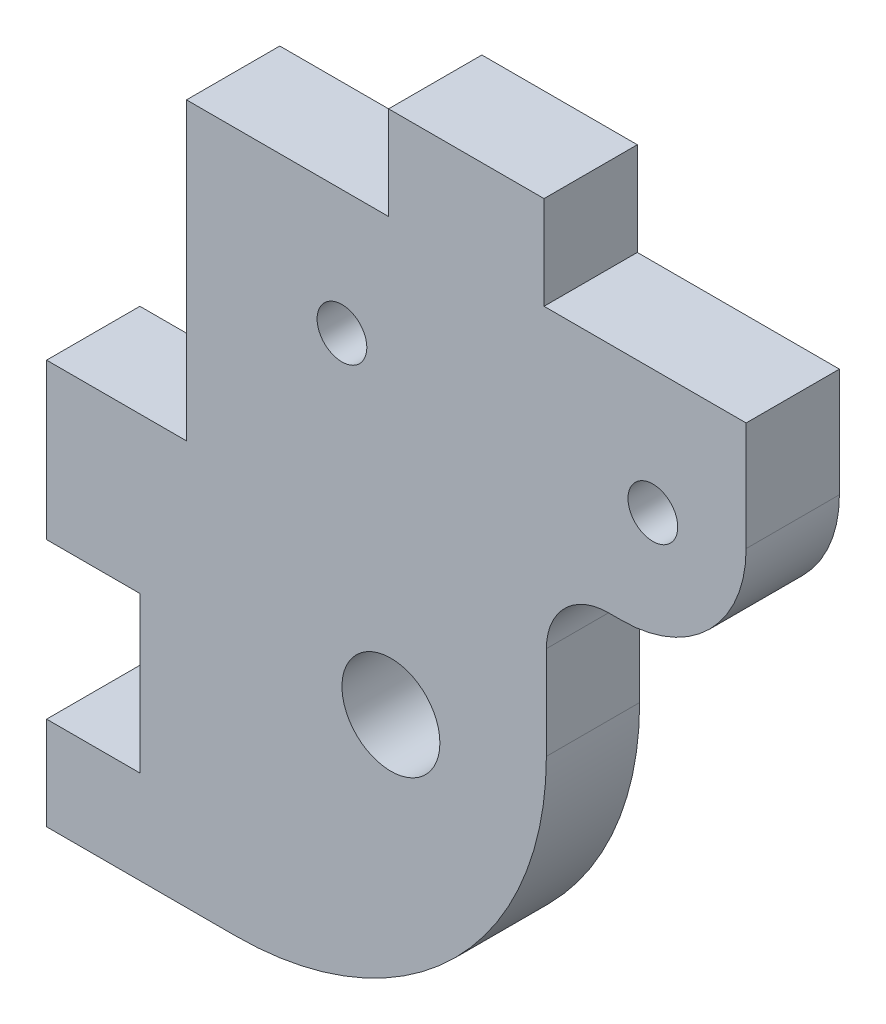
ISO-10303-21;
HEADER;
FILE_DESCRIPTION(('STEP AP214'),'2;1');
FILE_NAME('part.step','',(''),(''),'','','');
FILE_SCHEMA(('AUTOMOTIVE_DESIGN { 1 0 10303 214 1 1 1 1 }'));
ENDSEC;
DATA;
#1=APPLICATION_CONTEXT('core data for automotive mechanical design processes');
#2=APPLICATION_PROTOCOL_DEFINITION('international standard','automotive_design',2000,#1);
#3=PRODUCT_CONTEXT('',#1,'mechanical');
#4=PRODUCT('Part','Part','',(#3));
#5=PRODUCT_RELATED_PRODUCT_CATEGORY('part','',(#4));
#6=PRODUCT_DEFINITION_FORMATION('','',#4);
#7=PRODUCT_DEFINITION_CONTEXT('part definition',#1,'design');
#8=PRODUCT_DEFINITION('design','',#6,#7);
#9=PRODUCT_DEFINITION_SHAPE('','',#8);
#10=(LENGTH_UNIT() NAMED_UNIT(*) SI_UNIT(.MILLI.,.METRE.));
#11=(NAMED_UNIT(*) PLANE_ANGLE_UNIT() SI_UNIT($,.RADIAN.));
#12=(NAMED_UNIT(*) SI_UNIT($,.STERADIAN.) SOLID_ANGLE_UNIT());
#13=UNCERTAINTY_MEASURE_WITH_UNIT(LENGTH_MEASURE(1.E-05),#10,'distance_accuracy_value','');
#14=(GEOMETRIC_REPRESENTATION_CONTEXT(3) GLOBAL_UNCERTAINTY_ASSIGNED_CONTEXT((#13)) GLOBAL_UNIT_ASSIGNED_CONTEXT((#10,
#11,#12)) REPRESENTATION_CONTEXT('',''));
#15=CARTESIAN_POINT('',(0.,0.,0.));
#16=DIRECTION('',(0.,0.,1.));
#17=DIRECTION('',(1.,0.,0.));
#18=AXIS2_PLACEMENT_3D('',#15,#16,#17);
#19=CARTESIAN_POINT('',(9.,0.,6.));
#20=DIRECTION('',(-1.,0.,0.));
#21=DIRECTION('',(0.,0.,1.));
#22=AXIS2_PLACEMENT_3D('',#19,#20,#21);
#23=PLANE('',#22);
#24=DIRECTION('',(0.,1.,0.));
#25=VECTOR('',#24,1.);
#26=CARTESIAN_POINT('',(9.,0.,0.));
#27=LINE('',#26,#25);
#28=CARTESIAN_POINT('',(9.,-19.,0.));
#29=VERTEX_POINT('',#28);
#30=CARTESIAN_POINT('',(9.,0.,0.));
#31=VERTEX_POINT('',#30);
#32=EDGE_CURVE('E169',#29,#31,#27,.T.);
#33=ORIENTED_EDGE('',*,*,#32,.F.);
#34=DIRECTION('',(0.,0.,-1.));
#35=VECTOR('',#34,1.);
#36=CARTESIAN_POINT('',(9.,-19.,6.));
#37=LINE('',#36,#35);
#38=CARTESIAN_POINT('',(9.,-19.,6.));
#39=VERTEX_POINT('',#38);
#40=EDGE_CURVE('E164',#39,#29,#37,.T.);
#41=ORIENTED_EDGE('',*,*,#40,.F.);
#42=DIRECTION('',(0.,1.,0.));
#43=VECTOR('',#42,1.);
#44=CARTESIAN_POINT('',(9.,0.,6.));
#45=LINE('',#44,#43);
#46=CARTESIAN_POINT('',(9.,0.,6.));
#47=VERTEX_POINT('',#46);
#48=EDGE_CURVE('E166',#39,#47,#45,.T.);
#49=ORIENTED_EDGE('',*,*,#48,.T.);
#50=DIRECTION('',(0.,0.,-1.));
#51=VECTOR('',#50,1.);
#52=CARTESIAN_POINT('',(9.,0.,6.));
#53=LINE('',#52,#51);
#54=EDGE_CURVE('E269',#47,#31,#53,.T.);
#55=ORIENTED_EDGE('',*,*,#54,.T.);
#56=EDGE_LOOP('',(#33,#41,#49,#55));
#57=FACE_BOUND('',#56,.T.);
#58=ADVANCED_FACE('F35',(#57),#23,.T.);
#59=CARTESIAN_POINT('',(0.,-19.,6.));
#60=DIRECTION('',(0.,1.,0.));
#61=DIRECTION('',(0.,0.,1.));
#62=AXIS2_PLACEMENT_3D('',#59,#60,#61);
#63=PLANE('',#62);
#64=DIRECTION('',(1.,0.,0.));
#65=VECTOR('',#64,1.);
#66=CARTESIAN_POINT('',(0.,-19.,0.));
#67=LINE('',#66,#65);
#68=CARTESIAN_POINT('',(0.,-19.,0.));
#69=VERTEX_POINT('',#68);
#70=EDGE_CURVE('E232',#69,#29,#67,.T.);
#71=ORIENTED_EDGE('',*,*,#70,.F.);
#72=DIRECTION('',(0.,0.,-1.));
#73=VECTOR('',#72,1.);
#74=CARTESIAN_POINT('',(0.,-19.,6.));
#75=LINE('',#74,#73);
#76=CARTESIAN_POINT('',(0.,-19.,6.));
#77=VERTEX_POINT('',#76);
#78=EDGE_CURVE('E175',#77,#69,#75,.T.);
#79=ORIENTED_EDGE('',*,*,#78,.F.);
#80=DIRECTION('',(1.,0.,0.));
#81=VECTOR('',#80,1.);
#82=CARTESIAN_POINT('',(0.,-19.,6.));
#83=LINE('',#82,#81);
#84=EDGE_CURVE('E181',#77,#39,#83,.T.);
#85=ORIENTED_EDGE('',*,*,#84,.T.);
#86=ORIENTED_EDGE('',*,*,#40,.T.);
#87=EDGE_LOOP('',(#71,#79,#85,#86));
#88=FACE_BOUND('',#87,.T.);
#89=ADVANCED_FACE('F187',(#88),#63,.T.);
#90=CARTESIAN_POINT('',(0.,0.,6.));
#91=DIRECTION('',(-1.,0.,0.));
#92=DIRECTION('',(0.,0.,1.));
#93=AXIS2_PLACEMENT_3D('',#90,#91,#92);
#94=PLANE('',#93);
#95=DIRECTION('',(0.,1.,0.));
#96=VECTOR('',#95,1.);
#97=CARTESIAN_POINT('',(0.,0.,0.));
#98=LINE('',#97,#96);
#99=CARTESIAN_POINT('',(0.,-29.,0.));
#100=VERTEX_POINT('',#99);
#101=EDGE_CURVE('E234',#100,#69,#98,.T.);
#102=ORIENTED_EDGE('',*,*,#101,.F.);
#103=DIRECTION('',(0.,0.,-1.));
#104=VECTOR('',#103,1.);
#105=CARTESIAN_POINT('',(0.,-29.,6.));
#106=LINE('',#105,#104);
#107=CARTESIAN_POINT('',(0.,-29.,6.));
#108=VERTEX_POINT('',#107);
#109=EDGE_CURVE('E291',#108,#100,#106,.T.);
#110=ORIENTED_EDGE('',*,*,#109,.F.);
#111=DIRECTION('',(0.,1.,0.));
#112=VECTOR('',#111,1.);
#113=CARTESIAN_POINT('',(0.,0.,6.));
#114=LINE('',#113,#112);
#115=EDGE_CURVE('E188',#108,#77,#114,.T.);
#116=ORIENTED_EDGE('',*,*,#115,.T.);
#117=ORIENTED_EDGE('',*,*,#78,.T.);
#118=EDGE_LOOP('',(#102,#110,#116,#117));
#119=FACE_BOUND('',#118,.T.);
#120=ADVANCED_FACE('F366',(#119),#94,.T.);
#121=CARTESIAN_POINT('',(0.,-29.,6.));
#122=DIRECTION('',(0.,-1.,0.));
#123=DIRECTION('',(1.,0.,0.));
#124=AXIS2_PLACEMENT_3D('',#121,#122,#123);
#125=PLANE('',#124);
#126=DIRECTION('',(-1.,0.,0.));
#127=VECTOR('',#126,1.);
#128=CARTESIAN_POINT('',(0.,-29.,0.));
#129=LINE('',#128,#127);
#130=CARTESIAN_POINT('',(6.,-29.,0.));
#131=VERTEX_POINT('',#130);
#132=EDGE_CURVE('E237',#131,#100,#129,.T.);
#133=ORIENTED_EDGE('',*,*,#132,.F.);
#134=DIRECTION('',(0.,0.,-1.));
#135=VECTOR('',#134,1.);
#136=CARTESIAN_POINT('',(6.,-29.,6.));
#137=LINE('',#136,#135);
#138=CARTESIAN_POINT('',(6.,-29.,6.));
#139=VERTEX_POINT('',#138);
#140=EDGE_CURVE('E289',#139,#131,#137,.T.);
#141=ORIENTED_EDGE('',*,*,#140,.F.);
#142=DIRECTION('',(-1.,0.,0.));
#143=VECTOR('',#142,1.);
#144=CARTESIAN_POINT('',(0.,-29.,6.));
#145=LINE('',#144,#143);
#146=EDGE_CURVE('E190',#139,#108,#145,.T.);
#147=ORIENTED_EDGE('',*,*,#146,.T.);
#148=ORIENTED_EDGE('',*,*,#109,.T.);
#149=EDGE_LOOP('',(#133,#141,#147,#148));
#150=FACE_BOUND('',#149,.T.);
#151=ADVANCED_FACE('F370',(#150),#125,.T.);
#152=CARTESIAN_POINT('',(6.,0.,6.));
#153=DIRECTION('',(-1.,0.,0.));
#154=DIRECTION('',(0.,0.,1.));
#155=AXIS2_PLACEMENT_3D('',#152,#153,#154);
#156=PLANE('',#155);
#157=DIRECTION('',(0.,1.,0.));
#158=VECTOR('',#157,1.);
#159=CARTESIAN_POINT('',(6.,0.,0.));
#160=LINE('',#159,#158);
#161=CARTESIAN_POINT('',(6.,-39.,0.));
#162=VERTEX_POINT('',#161);
#163=EDGE_CURVE('E241',#162,#131,#160,.T.);
#164=ORIENTED_EDGE('',*,*,#163,.F.);
#165=DIRECTION('',(0.,0.,-1.));
#166=VECTOR('',#165,1.);
#167=CARTESIAN_POINT('',(6.,-39.,6.));
#168=LINE('',#167,#166);
#169=CARTESIAN_POINT('',(6.,-39.,6.));
#170=VERTEX_POINT('',#169);
#171=EDGE_CURVE('E287',#170,#162,#168,.T.);
#172=ORIENTED_EDGE('',*,*,#171,.F.);
#173=DIRECTION('',(0.,1.,0.));
#174=VECTOR('',#173,1.);
#175=CARTESIAN_POINT('',(6.,0.,6.));
#176=LINE('',#175,#174);
#177=EDGE_CURVE('E197',#170,#139,#176,.T.);
#178=ORIENTED_EDGE('',*,*,#177,.T.);
#179=ORIENTED_EDGE('',*,*,#140,.T.);
#180=EDGE_LOOP('',(#164,#172,#178,#179));
#181=FACE_BOUND('',#180,.T.);
#182=ADVANCED_FACE('F373',(#181),#156,.T.);
#183=CARTESIAN_POINT('',(0.,-39.,6.));
#184=DIRECTION('',(0.,-1.,0.));
#185=DIRECTION('',(0.,0.,-1.));
#186=AXIS2_PLACEMENT_3D('',#183,#184,#185);
#187=PLANE('',#186);
#188=DIRECTION('',(-1.,0.,0.));
#189=VECTOR('',#188,1.);
#190=CARTESIAN_POINT('',(0.,-39.,0.));
#191=LINE('',#190,#189);
#192=CARTESIAN_POINT('',(0.,-39.,0.));
#193=VERTEX_POINT('',#192);
#194=EDGE_CURVE('E244',#162,#193,#191,.T.);
#195=ORIENTED_EDGE('',*,*,#194,.T.);
#196=DIRECTION('',(0.,0.,-1.));
#197=VECTOR('',#196,1.);
#198=CARTESIAN_POINT('',(0.,-39.,6.));
#199=LINE('',#198,#197);
#200=CARTESIAN_POINT('',(0.,-39.,6.));
#201=VERTEX_POINT('',#200);
#202=EDGE_CURVE('E285',#201,#193,#199,.T.);
#203=ORIENTED_EDGE('',*,*,#202,.F.);
#204=DIRECTION('',(-1.,0.,0.));
#205=VECTOR('',#204,1.);
#206=CARTESIAN_POINT('',(0.,-39.,6.));
#207=LINE('',#206,#205);
#208=EDGE_CURVE('E200',#170,#201,#207,.T.);
#209=ORIENTED_EDGE('',*,*,#208,.F.);
#210=ORIENTED_EDGE('',*,*,#171,.T.);
#211=EDGE_LOOP('',(#195,#203,#209,#210));
#212=FACE_BOUND('',#211,.T.);
#213=ADVANCED_FACE('F379',(#212),#187,.F.);
#214=CARTESIAN_POINT('',(0.,-45.,0.));
#215=VERTEX_POINT('',#214);
#216=EDGE_CURVE('E238',#215,#193,#98,.T.);
#217=ORIENTED_EDGE('',*,*,#216,.F.);
#218=DIRECTION('',(0.,0.,-1.));
#219=VECTOR('',#218,1.);
#220=CARTESIAN_POINT('',(0.,-45.,6.));
#221=LINE('',#220,#219);
#222=CARTESIAN_POINT('',(0.,-45.,6.));
#223=VERTEX_POINT('',#222);
#224=EDGE_CURVE('E282',#223,#215,#221,.T.);
#225=ORIENTED_EDGE('',*,*,#224,.F.);
#226=EDGE_CURVE('E192',#223,#201,#114,.T.);
#227=ORIENTED_EDGE('',*,*,#226,.T.);
#228=ORIENTED_EDGE('',*,*,#202,.T.);
#229=EDGE_LOOP('',(#217,#225,#227,#228));
#230=FACE_BOUND('',#229,.T.);
#231=ADVANCED_FACE('F385',(#230),#94,.T.);
#232=CARTESIAN_POINT('',(0.,-45.,6.));
#233=DIRECTION('',(0.,-1.,0.));
#234=DIRECTION('',(1.,0.,0.));
#235=AXIS2_PLACEMENT_3D('',#232,#233,#234);
#236=PLANE('',#235);
#237=DIRECTION('',(-1.,0.,0.));
#238=VECTOR('',#237,1.);
#239=CARTESIAN_POINT('',(0.,-45.,0.));
#240=LINE('',#239,#238);
#241=CARTESIAN_POINT('',(12.15,-45.,0.));
#242=VERTEX_POINT('',#241);
#243=EDGE_CURVE('E247',#242,#215,#240,.T.);
#244=ORIENTED_EDGE('',*,*,#243,.F.);
#245=DIRECTION('',(0.,0.,-1.));
#246=VECTOR('',#245,1.);
#247=CARTESIAN_POINT('',(12.15,-45.,6.));
#248=LINE('',#247,#246);
#249=CARTESIAN_POINT('',(12.15,-45.,6.));
#250=VERTEX_POINT('',#249);
#251=EDGE_CURVE('E43',#242,#250,#248,.F.);
#252=ORIENTED_EDGE('',*,*,#251,.T.);
#253=DIRECTION('',(-1.,0.,0.));
#254=VECTOR('',#253,1.);
#255=CARTESIAN_POINT('',(0.,-45.,6.));
#256=LINE('',#255,#254);
#257=EDGE_CURVE('E202',#250,#223,#256,.T.);
#258=ORIENTED_EDGE('',*,*,#257,.T.);
#259=ORIENTED_EDGE('',*,*,#224,.T.);
#260=EDGE_LOOP('',(#244,#252,#258,#259));
#261=FACE_BOUND('',#260,.T.);
#262=ADVANCED_FACE('F386',(#261),#236,.T.);
#263=CARTESIAN_POINT('',(32.15,0.,6.));
#264=DIRECTION('',(-1.,0.,0.));
#265=DIRECTION('',(0.,0.,1.));
#266=AXIS2_PLACEMENT_3D('',#263,#264,#265);
#267=PLANE('',#266);
#268=DIRECTION('',(0.,1.,0.));
#269=VECTOR('',#268,1.);
#270=CARTESIAN_POINT('',(32.15,0.,6.));
#271=LINE('',#270,#269);
#272=CARTESIAN_POINT('',(32.15,-25.,6.));
#273=VERTEX_POINT('',#272);
#274=CARTESIAN_POINT('',(32.15,-19.,6.));
#275=VERTEX_POINT('',#274);
#276=EDGE_CURVE('E204',#273,#275,#271,.T.);
#277=ORIENTED_EDGE('',*,*,#276,.F.);
#278=DIRECTION('',(0.,0.,-1.));
#279=VECTOR('',#278,1.);
#280=CARTESIAN_POINT('',(32.15,-25.,0.));
#281=LINE('',#280,#279);
#282=CARTESIAN_POINT('',(32.15,-25.,0.));
#283=VERTEX_POINT('',#282);
#284=EDGE_CURVE('E315',#273,#283,#281,.T.);
#285=ORIENTED_EDGE('',*,*,#284,.T.);
#286=DIRECTION('',(0.,1.,0.));
#287=VECTOR('',#286,1.);
#288=CARTESIAN_POINT('',(32.15,0.,0.));
#289=LINE('',#288,#287);
#290=CARTESIAN_POINT('',(32.15,-19.,0.));
#291=VERTEX_POINT('',#290);
#292=EDGE_CURVE('E249',#283,#291,#289,.T.);
#293=ORIENTED_EDGE('',*,*,#292,.T.);
#294=DIRECTION('',(0.,0.,-1.));
#295=VECTOR('',#294,1.);
#296=CARTESIAN_POINT('',(32.15,-19.,6.));
#297=LINE('',#296,#295);
#298=EDGE_CURVE('E307',#291,#275,#297,.F.);
#299=ORIENTED_EDGE('',*,*,#298,.T.);
#300=EDGE_LOOP('',(#277,#285,#293,#299));
#301=FACE_BOUND('',#300,.T.);
#302=ADVANCED_FACE('F321',(#301),#267,.F.);
#303=CARTESIAN_POINT('',(0.,-15.,6.));
#304=DIRECTION('',(0.,1.,0.));
#305=DIRECTION('',(-1.,0.,0.));
#306=AXIS2_PLACEMENT_3D('',#303,#304,#305);
#307=PLANE('',#306);
#308=DIRECTION('',(1.,0.,0.));
#309=VECTOR('',#308,1.);
#310=CARTESIAN_POINT('',(0.,-15.,6.));
#311=LINE('',#310,#309);
#312=CARTESIAN_POINT('',(36.15,-15.,6.));
#313=VERTEX_POINT('',#312);
#314=CARTESIAN_POINT('',(37.,-15.,6.));
#315=VERTEX_POINT('',#314);
#316=EDGE_CURVE('E206',#313,#315,#311,.T.);
#317=ORIENTED_EDGE('',*,*,#316,.F.);
#318=DIRECTION('',(0.,0.,-1.));
#319=VECTOR('',#318,1.);
#320=CARTESIAN_POINT('',(36.15,-15.,0.));
#321=LINE('',#320,#319);
#322=CARTESIAN_POINT('',(36.15,-15.,0.));
#323=VERTEX_POINT('',#322);
#324=EDGE_CURVE('E304',#313,#323,#321,.T.);
#325=ORIENTED_EDGE('',*,*,#324,.T.);
#326=DIRECTION('',(1.,0.,0.));
#327=VECTOR('',#326,1.);
#328=CARTESIAN_POINT('',(0.,-15.,0.));
#329=LINE('',#328,#327);
#330=CARTESIAN_POINT('',(37.,-15.,0.));
#331=VERTEX_POINT('',#330);
#332=EDGE_CURVE('E251',#323,#331,#329,.T.);
#333=ORIENTED_EDGE('',*,*,#332,.T.);
#334=DIRECTION('',(0.,0.,-1.));
#335=VECTOR('',#334,1.);
#336=CARTESIAN_POINT('',(37.,-15.,6.));
#337=LINE('',#336,#335);
#338=EDGE_CURVE('E299',#331,#315,#337,.F.);
#339=ORIENTED_EDGE('',*,*,#338,.T.);
#340=EDGE_LOOP('',(#317,#325,#333,#339));
#341=FACE_BOUND('',#340,.T.);
#342=ADVANCED_FACE('F333',(#341),#307,.F.);
#343=CARTESIAN_POINT('',(45.,0.,6.));
#344=DIRECTION('',(1.,0.,0.));
#345=DIRECTION('',(0.,1.,0.));
#346=AXIS2_PLACEMENT_3D('',#343,#344,#345);
#347=PLANE('',#346);
#348=DIRECTION('',(0.,-1.,0.));
#349=VECTOR('',#348,1.);
#350=CARTESIAN_POINT('',(45.,0.,6.));
#351=LINE('',#350,#349);
#352=CARTESIAN_POINT('',(45.,0.,6.));
#353=VERTEX_POINT('',#352);
#354=CARTESIAN_POINT('',(45.,-7.,6.));
#355=VERTEX_POINT('',#354);
#356=EDGE_CURVE('E208',#353,#355,#351,.T.);
#357=ORIENTED_EDGE('',*,*,#356,.T.);
#358=DIRECTION('',(0.,0.,-1.));
#359=VECTOR('',#358,1.);
#360=CARTESIAN_POINT('',(45.,-7.,0.));
#361=LINE('',#360,#359);
#362=CARTESIAN_POINT('',(45.,-7.,0.));
#363=VERTEX_POINT('',#362);
#364=EDGE_CURVE('E174',#355,#363,#361,.T.);
#365=ORIENTED_EDGE('',*,*,#364,.T.);
#366=DIRECTION('',(0.,-1.,0.));
#367=VECTOR('',#366,1.);
#368=CARTESIAN_POINT('',(45.,0.,0.));
#369=LINE('',#368,#367);
#370=CARTESIAN_POINT('',(45.,0.,0.));
#371=VERTEX_POINT('',#370);
#372=EDGE_CURVE('E253',#371,#363,#369,.T.);
#373=ORIENTED_EDGE('',*,*,#372,.F.);
#374=DIRECTION('',(0.,0.,-1.));
#375=VECTOR('',#374,1.);
#376=CARTESIAN_POINT('',(45.,0.,6.));
#377=LINE('',#376,#375);
#378=EDGE_CURVE('E280',#353,#371,#377,.T.);
#379=ORIENTED_EDGE('',*,*,#378,.F.);
#380=EDGE_LOOP('',(#357,#365,#373,#379));
#381=FACE_BOUND('',#380,.T.);
#382=ADVANCED_FACE('F342',(#381),#347,.T.);
#383=CARTESIAN_POINT('',(0.,0.,6.));
#384=DIRECTION('',(0.,1.,0.));
#385=DIRECTION('',(-1.,0.,0.));
#386=AXIS2_PLACEMENT_3D('',#383,#384,#385);
#387=PLANE('',#386);
#388=DIRECTION('',(1.,0.,0.));
#389=VECTOR('',#388,1.);
#390=CARTESIAN_POINT('',(0.,0.,0.));
#391=LINE('',#390,#389);
#392=CARTESIAN_POINT('',(32.,0.,0.));
#393=VERTEX_POINT('',#392);
#394=EDGE_CURVE('E256',#393,#371,#391,.T.);
#395=ORIENTED_EDGE('',*,*,#394,.F.);
#396=DIRECTION('',(0.,0.,-1.));
#397=VECTOR('',#396,1.);
#398=CARTESIAN_POINT('',(32.,0.,6.));
#399=LINE('',#398,#397);
#400=CARTESIAN_POINT('',(32.,0.,6.));
#401=VERTEX_POINT('',#400);
#402=EDGE_CURVE('E278',#401,#393,#399,.T.);
#403=ORIENTED_EDGE('',*,*,#402,.F.);
#404=DIRECTION('',(1.,0.,0.));
#405=VECTOR('',#404,1.);
#406=CARTESIAN_POINT('',(0.,0.,6.));
#407=LINE('',#406,#405);
#408=EDGE_CURVE('E211',#401,#353,#407,.T.);
#409=ORIENTED_EDGE('',*,*,#408,.T.);
#410=ORIENTED_EDGE('',*,*,#378,.T.);
#411=EDGE_LOOP('',(#395,#403,#409,#410));
#412=FACE_BOUND('',#411,.T.);
#413=ADVANCED_FACE('F346',(#412),#387,.T.);
#414=CARTESIAN_POINT('',(32.,0.,6.));
#415=DIRECTION('',(1.,0.,0.));
#416=DIRECTION('',(0.,0.,-1.));
#417=AXIS2_PLACEMENT_3D('',#414,#415,#416);
#418=PLANE('',#417);
#419=DIRECTION('',(0.,-1.,0.));
#420=VECTOR('',#419,1.);
#421=CARTESIAN_POINT('',(32.,0.,0.));
#422=LINE('',#421,#420);
#423=CARTESIAN_POINT('',(32.,6.,0.));
#424=VERTEX_POINT('',#423);
#425=EDGE_CURVE('E259',#424,#393,#422,.T.);
#426=ORIENTED_EDGE('',*,*,#425,.F.);
#427=DIRECTION('',(0.,0.,-1.));
#428=VECTOR('',#427,1.);
#429=CARTESIAN_POINT('',(32.,6.,6.));
#430=LINE('',#429,#428);
#431=CARTESIAN_POINT('',(32.,6.,6.));
#432=VERTEX_POINT('',#431);
#433=EDGE_CURVE('E276',#432,#424,#430,.T.);
#434=ORIENTED_EDGE('',*,*,#433,.F.);
#435=DIRECTION('',(0.,-1.,0.));
#436=VECTOR('',#435,1.);
#437=CARTESIAN_POINT('',(32.,0.,6.));
#438=LINE('',#437,#436);
#439=EDGE_CURVE('E214',#432,#401,#438,.T.);
#440=ORIENTED_EDGE('',*,*,#439,.T.);
#441=ORIENTED_EDGE('',*,*,#402,.T.);
#442=EDGE_LOOP('',(#426,#434,#440,#441));
#443=FACE_BOUND('',#442,.T.);
#444=ADVANCED_FACE('F350',(#443),#418,.T.);
#445=CARTESIAN_POINT('',(0.,6.,6.));
#446=DIRECTION('',(0.,-1.,0.));
#447=DIRECTION('',(1.,0.,0.));
#448=AXIS2_PLACEMENT_3D('',#445,#446,#447);
#449=PLANE('',#448);
#450=DIRECTION('',(-1.,0.,0.));
#451=VECTOR('',#450,1.);
#452=CARTESIAN_POINT('',(0.,6.,0.));
#453=LINE('',#452,#451);
#454=CARTESIAN_POINT('',(22.,6.,0.));
#455=VERTEX_POINT('',#454);
#456=EDGE_CURVE('E263',#424,#455,#453,.T.);
#457=ORIENTED_EDGE('',*,*,#456,.T.);
#458=DIRECTION('',(0.,0.,-1.));
#459=VECTOR('',#458,1.);
#460=CARTESIAN_POINT('',(22.,6.,6.));
#461=LINE('',#460,#459);
#462=CARTESIAN_POINT('',(22.,6.,6.));
#463=VERTEX_POINT('',#462);
#464=EDGE_CURVE('E273',#463,#455,#461,.T.);
#465=ORIENTED_EDGE('',*,*,#464,.F.);
#466=DIRECTION('',(-1.,0.,0.));
#467=VECTOR('',#466,1.);
#468=CARTESIAN_POINT('',(0.,6.,6.));
#469=LINE('',#468,#467);
#470=EDGE_CURVE('E217',#432,#463,#469,.T.);
#471=ORIENTED_EDGE('',*,*,#470,.F.);
#472=ORIENTED_EDGE('',*,*,#433,.T.);
#473=EDGE_LOOP('',(#457,#465,#471,#472));
#474=FACE_BOUND('',#473,.T.);
#475=ADVANCED_FACE('F355',(#474),#449,.F.);
#476=CARTESIAN_POINT('',(22.,0.,6.));
#477=DIRECTION('',(1.,0.,0.));
#478=DIRECTION('',(0.,0.,-1.));
#479=AXIS2_PLACEMENT_3D('',#476,#477,#478);
#480=PLANE('',#479);
#481=DIRECTION('',(0.,-1.,0.));
#482=VECTOR('',#481,1.);
#483=CARTESIAN_POINT('',(22.,0.,0.));
#484=LINE('',#483,#482);
#485=CARTESIAN_POINT('',(22.,0.,0.));
#486=VERTEX_POINT('',#485);
#487=EDGE_CURVE('E266',#455,#486,#484,.T.);
#488=ORIENTED_EDGE('',*,*,#487,.T.);
#489=DIRECTION('',(0.,0.,-1.));
#490=VECTOR('',#489,1.);
#491=CARTESIAN_POINT('',(22.,0.,6.));
#492=LINE('',#491,#490);
#493=CARTESIAN_POINT('',(22.,0.,6.));
#494=VERTEX_POINT('',#493);
#495=EDGE_CURVE('E271',#494,#486,#492,.T.);
#496=ORIENTED_EDGE('',*,*,#495,.F.);
#497=DIRECTION('',(0.,-1.,0.));
#498=VECTOR('',#497,1.);
#499=CARTESIAN_POINT('',(22.,0.,6.));
#500=LINE('',#499,#498);
#501=EDGE_CURVE('E220',#463,#494,#500,.T.);
#502=ORIENTED_EDGE('',*,*,#501,.F.);
#503=ORIENTED_EDGE('',*,*,#464,.T.);
#504=EDGE_LOOP('',(#488,#496,#502,#503));
#505=FACE_BOUND('',#504,.T.);
#506=ADVANCED_FACE('F358',(#505),#480,.F.);
#507=CARTESIAN_POINT('',(22.15,-27.6808495852448,6.));
#508=DIRECTION('',(0.,0.,-1.));
#509=DIRECTION('',(-1.,0.,0.));
#510=AXIS2_PLACEMENT_3D('',#507,#508,#509);
#511=CYLINDRICAL_SURFACE('',#510,3.14999999999995);
#512=CARTESIAN_POINT('',(22.15,-27.6808495852448,6.));
#513=DIRECTION('',(0.,0.,1.));
#514=DIRECTION('',(1.,0.,0.));
#515=AXIS2_PLACEMENT_3D('',#512,#513,#514);
#516=CIRCLE('',#515,3.14999999999995);
#517=CARTESIAN_POINT('',(25.3,-27.6808495852448,6.));
#518=VERTEX_POINT('',#517);
#519=EDGE_CURVE('E185',#518,#518,#516,.T.);
#520=ORIENTED_EDGE('',*,*,#519,.T.);
#521=EDGE_LOOP('',(#520));
#522=FACE_BOUND('',#521,.T.);
#523=CARTESIAN_POINT('',(22.15,-27.6808495852448,0.));
#524=DIRECTION('',(0.,0.,1.));
#525=DIRECTION('',(1.,0.,0.));
#526=AXIS2_PLACEMENT_3D('',#523,#524,#525);
#527=CIRCLE('',#526,3.14999999999995);
#528=CARTESIAN_POINT('',(25.3,-27.6808495852448,0.));
#529=VERTEX_POINT('',#528);
#530=EDGE_CURVE('E228',#529,#529,#527,.T.);
#531=ORIENTED_EDGE('',*,*,#530,.F.);
#532=EDGE_LOOP('',(#531));
#533=FACE_BOUND('',#532,.T.);
#534=ADVANCED_FACE('F399',(#522,#533),#511,.F.);
#535=CARTESIAN_POINT('',(39.,-8.,6.));
#536=DIRECTION('',(0.,0.,-1.));
#537=DIRECTION('',(-1.,0.,0.));
#538=AXIS2_PLACEMENT_3D('',#535,#536,#537);
#539=CYLINDRICAL_SURFACE('',#538,1.5999999999999);
#540=CARTESIAN_POINT('',(39.,-8.,6.));
#541=DIRECTION('',(0.,0.,1.));
#542=DIRECTION('',(1.,0.,0.));
#543=AXIS2_PLACEMENT_3D('',#540,#541,#542);
#544=CIRCLE('',#543,1.5999999999999);
#545=CARTESIAN_POINT('',(40.5999999999999,-8.,6.));
#546=VERTEX_POINT('',#545);
#547=EDGE_CURVE('E622',#546,#546,#544,.T.);
#548=ORIENTED_EDGE('',*,*,#547,.T.);
#549=EDGE_LOOP('',(#548));
#550=FACE_BOUND('',#549,.T.);
#551=CARTESIAN_POINT('',(39.,-8.,0.));
#552=DIRECTION('',(0.,0.,1.));
#553=DIRECTION('',(1.,0.,0.));
#554=AXIS2_PLACEMENT_3D('',#551,#552,#553);
#555=CIRCLE('',#554,1.5999999999999);
#556=CARTESIAN_POINT('',(40.5999999999999,-8.,0.));
#557=VERTEX_POINT('',#556);
#558=EDGE_CURVE('E225',#557,#557,#555,.T.);
#559=ORIENTED_EDGE('',*,*,#558,.F.);
#560=EDGE_LOOP('',(#559));
#561=FACE_BOUND('',#560,.T.);
#562=ADVANCED_FACE('F402',(#550,#561),#539,.F.);
#563=CARTESIAN_POINT('',(19.,-8.,6.));
#564=DIRECTION('',(0.,0.,-1.));
#565=DIRECTION('',(-1.,0.,0.));
#566=AXIS2_PLACEMENT_3D('',#563,#564,#565);
#567=CYLINDRICAL_SURFACE('',#566,1.6);
#568=CARTESIAN_POINT('',(19.,-8.,6.));
#569=DIRECTION('',(0.,0.,1.));
#570=DIRECTION('',(1.,0.,0.));
#571=AXIS2_PLACEMENT_3D('',#568,#569,#570);
#572=CIRCLE('',#571,1.6);
#573=CARTESIAN_POINT('',(20.6,-8.,6.));
#574=VERTEX_POINT('',#573);
#575=EDGE_CURVE('E618',#574,#574,#572,.T.);
#576=ORIENTED_EDGE('',*,*,#575,.T.);
#577=EDGE_LOOP('',(#576));
#578=FACE_BOUND('',#577,.T.);
#579=CARTESIAN_POINT('',(19.,-8.,0.));
#580=DIRECTION('',(0.,0.,1.));
#581=DIRECTION('',(1.,0.,0.));
#582=AXIS2_PLACEMENT_3D('',#579,#580,#581);
#583=CIRCLE('',#582,1.6);
#584=CARTESIAN_POINT('',(20.6,-8.,0.));
#585=VERTEX_POINT('',#584);
#586=EDGE_CURVE('E222',#585,#585,#583,.T.);
#587=ORIENTED_EDGE('',*,*,#586,.F.);
#588=EDGE_LOOP('',(#587));
#589=FACE_BOUND('',#588,.T.);
#590=ADVANCED_FACE('F406',(#578,#589),#567,.F.);
#591=EDGE_CURVE('E260',#31,#486,#391,.T.);
#592=ORIENTED_EDGE('',*,*,#591,.F.);
#593=ORIENTED_EDGE('',*,*,#54,.F.);
#594=EDGE_CURVE('E184',#47,#494,#407,.T.);
#595=ORIENTED_EDGE('',*,*,#594,.T.);
#596=ORIENTED_EDGE('',*,*,#495,.T.);
#597=EDGE_LOOP('',(#592,#593,#595,#596));
#598=FACE_BOUND('',#597,.T.);
#599=ADVANCED_FACE('F362',(#598),#387,.T.);
#600=CARTESIAN_POINT('',(0.,0.,6.));
#601=DIRECTION('',(0.,0.,1.));
#602=DIRECTION('',(1.,0.,0.));
#603=AXIS2_PLACEMENT_3D('',#600,#601,#602);
#604=PLANE('',#603);
#605=ORIENTED_EDGE('',*,*,#575,.F.);
#606=EDGE_LOOP('',(#605));
#607=FACE_BOUND('',#606,.T.);
#608=ORIENTED_EDGE('',*,*,#547,.F.);
#609=EDGE_LOOP('',(#608));
#610=FACE_BOUND('',#609,.T.);
#611=ORIENTED_EDGE('',*,*,#519,.F.);
#612=EDGE_LOOP('',(#611));
#613=FACE_BOUND('',#612,.T.);
#614=ORIENTED_EDGE('',*,*,#257,.F.);
#615=CARTESIAN_POINT('',(12.15,-25.,6.));
#616=DIRECTION('',(0.,0.,1.));
#617=DIRECTION('',(1.,0.,0.));
#618=AXIS2_PLACEMENT_3D('',#615,#616,#617);
#619=CIRCLE('',#618,20.);
#620=EDGE_CURVE('E11',#250,#273,#619,.T.);
#621=ORIENTED_EDGE('',*,*,#620,.T.);
#622=ORIENTED_EDGE('',*,*,#276,.T.);
#623=CARTESIAN_POINT('',(36.15,-19.,6.));
#624=DIRECTION('',(0.,0.,1.));
#625=DIRECTION('',(1.,0.,0.));
#626=AXIS2_PLACEMENT_3D('',#623,#624,#625);
#627=CIRCLE('',#626,4.);
#628=EDGE_CURVE('E313',#275,#313,#627,.F.);
#629=ORIENTED_EDGE('',*,*,#628,.T.);
#630=ORIENTED_EDGE('',*,*,#316,.T.);
#631=CARTESIAN_POINT('',(37.,-7.,6.));
#632=DIRECTION('',(0.,0.,1.));
#633=DIRECTION('',(1.,0.,0.));
#634=AXIS2_PLACEMENT_3D('',#631,#632,#633);
#635=CIRCLE('',#634,8.);
#636=EDGE_CURVE('E302',#315,#355,#635,.T.);
#637=ORIENTED_EDGE('',*,*,#636,.T.);
#638=ORIENTED_EDGE('',*,*,#356,.F.);
#639=ORIENTED_EDGE('',*,*,#408,.F.);
#640=ORIENTED_EDGE('',*,*,#439,.F.);
#641=ORIENTED_EDGE('',*,*,#470,.T.);
#642=ORIENTED_EDGE('',*,*,#501,.T.);
#643=ORIENTED_EDGE('',*,*,#594,.F.);
#644=ORIENTED_EDGE('',*,*,#48,.F.);
#645=ORIENTED_EDGE('',*,*,#84,.F.);
#646=ORIENTED_EDGE('',*,*,#115,.F.);
#647=ORIENTED_EDGE('',*,*,#146,.F.);
#648=ORIENTED_EDGE('',*,*,#177,.F.);
#649=ORIENTED_EDGE('',*,*,#208,.T.);
#650=ORIENTED_EDGE('',*,*,#226,.F.);
#651=EDGE_LOOP('',(#614,#621,#622,#629,#630,#637,#638,#639,#640,#641,#642,#643,#644,#645,#646,
#647,#648,#649,#650));
#652=FACE_BOUND('',#651,.T.);
#653=ADVANCED_FACE('F179',(#607,#610,#613,#652),#604,.T.);
#654=CARTESIAN_POINT('',(0.,0.,0.));
#655=DIRECTION('',(0.,0.,1.));
#656=DIRECTION('',(1.,0.,0.));
#657=AXIS2_PLACEMENT_3D('',#654,#655,#656);
#658=PLANE('',#657);
#659=ORIENTED_EDGE('',*,*,#586,.T.);
#660=EDGE_LOOP('',(#659));
#661=FACE_BOUND('',#660,.T.);
#662=ORIENTED_EDGE('',*,*,#558,.T.);
#663=EDGE_LOOP('',(#662));
#664=FACE_BOUND('',#663,.T.);
#665=ORIENTED_EDGE('',*,*,#530,.T.);
#666=EDGE_LOOP('',(#665));
#667=FACE_BOUND('',#666,.T.);
#668=ORIENTED_EDGE('',*,*,#292,.F.);
#669=CARTESIAN_POINT('',(12.15,-25.,0.));
#670=DIRECTION('',(0.,0.,1.));
#671=DIRECTION('',(1.,0.,0.));
#672=AXIS2_PLACEMENT_3D('',#669,#670,#671);
#673=CIRCLE('',#672,20.);
#674=EDGE_CURVE('E57',#283,#242,#673,.F.);
#675=ORIENTED_EDGE('',*,*,#674,.T.);
#676=ORIENTED_EDGE('',*,*,#243,.T.);
#677=ORIENTED_EDGE('',*,*,#216,.T.);
#678=ORIENTED_EDGE('',*,*,#194,.F.);
#679=ORIENTED_EDGE('',*,*,#163,.T.);
#680=ORIENTED_EDGE('',*,*,#132,.T.);
#681=ORIENTED_EDGE('',*,*,#101,.T.);
#682=ORIENTED_EDGE('',*,*,#70,.T.);
#683=ORIENTED_EDGE('',*,*,#32,.T.);
#684=ORIENTED_EDGE('',*,*,#591,.T.);
#685=ORIENTED_EDGE('',*,*,#487,.F.);
#686=ORIENTED_EDGE('',*,*,#456,.F.);
#687=ORIENTED_EDGE('',*,*,#425,.T.);
#688=ORIENTED_EDGE('',*,*,#394,.T.);
#689=ORIENTED_EDGE('',*,*,#372,.T.);
#690=CARTESIAN_POINT('',(37.,-7.,0.));
#691=DIRECTION('',(0.,0.,1.));
#692=DIRECTION('',(1.,0.,0.));
#693=AXIS2_PLACEMENT_3D('',#690,#691,#692);
#694=CIRCLE('',#693,8.);
#695=EDGE_CURVE('E296',#363,#331,#694,.F.);
#696=ORIENTED_EDGE('',*,*,#695,.T.);
#697=ORIENTED_EDGE('',*,*,#332,.F.);
#698=CARTESIAN_POINT('',(36.15,-19.,0.));
#699=DIRECTION('',(0.,0.,1.));
#700=DIRECTION('',(1.,0.,0.));
#701=AXIS2_PLACEMENT_3D('',#698,#699,#700);
#702=CIRCLE('',#701,4.);
#703=EDGE_CURVE('E310',#323,#291,#702,.T.);
#704=ORIENTED_EDGE('',*,*,#703,.T.);
#705=EDGE_LOOP('',(#668,#675,#676,#677,#678,#679,#680,#681,#682,#683,#684,#685,#686,#687,#688,
#689,#696,#697,#704));
#706=FACE_BOUND('',#705,.T.);
#707=ADVANCED_FACE('F324',(#661,#664,#667,#706),#658,.F.);
#708=CARTESIAN_POINT('',(37.,-7.,6.));
#709=DIRECTION('',(0.,0.,1.));
#710=DIRECTION('',(1.,0.,0.));
#711=AXIS2_PLACEMENT_3D('',#708,#709,#710);
#712=CYLINDRICAL_SURFACE('',#711,8.);
#713=ORIENTED_EDGE('',*,*,#636,.F.);
#714=ORIENTED_EDGE('',*,*,#338,.F.);
#715=ORIENTED_EDGE('',*,*,#695,.F.);
#716=ORIENTED_EDGE('',*,*,#364,.F.);
#717=EDGE_LOOP('',(#713,#714,#715,#716));
#718=FACE_BOUND('',#717,.T.);
#719=ADVANCED_FACE('F338',(#718),#712,.T.);
#720=CARTESIAN_POINT('',(36.15,-19.,6.));
#721=DIRECTION('',(0.,0.,1.));
#722=DIRECTION('',(1.,0.,0.));
#723=AXIS2_PLACEMENT_3D('',#720,#721,#722);
#724=CYLINDRICAL_SURFACE('',#723,4.);
#725=ORIENTED_EDGE('',*,*,#628,.F.);
#726=ORIENTED_EDGE('',*,*,#298,.F.);
#727=ORIENTED_EDGE('',*,*,#703,.F.);
#728=ORIENTED_EDGE('',*,*,#324,.F.);
#729=EDGE_LOOP('',(#725,#726,#727,#728));
#730=FACE_BOUND('',#729,.T.);
#731=ADVANCED_FACE('F330',(#730),#724,.F.);
#732=CARTESIAN_POINT('',(12.15,-25.,6.));
#733=DIRECTION('',(0.,0.,1.));
#734=DIRECTION('',(1.,0.,0.));
#735=AXIS2_PLACEMENT_3D('',#732,#733,#734);
#736=CYLINDRICAL_SURFACE('',#735,20.);
#737=ORIENTED_EDGE('',*,*,#620,.F.);
#738=ORIENTED_EDGE('',*,*,#251,.F.);
#739=ORIENTED_EDGE('',*,*,#674,.F.);
#740=ORIENTED_EDGE('',*,*,#284,.F.);
#741=EDGE_LOOP('',(#737,#738,#739,#740));
#742=FACE_BOUND('',#741,.T.);
#743=ADVANCED_FACE('F37',(#742),#736,.T.);
#744=CLOSED_SHELL('',(#58,#89,#120,#151,#182,#213,#231,#262,#302,#342,#382,#413,#444,#475,#506,
#534,#562,#590,#599,#653,#707,#719,#731,#743));
#745=MANIFOLD_SOLID_BREP('B2',#744);
#746=ADVANCED_BREP_SHAPE_REPRESENTATION('',(#18,#745),#14);
#747=SHAPE_DEFINITION_REPRESENTATION(#9,#746);
ENDSEC;
END-ISO-10303-21;
